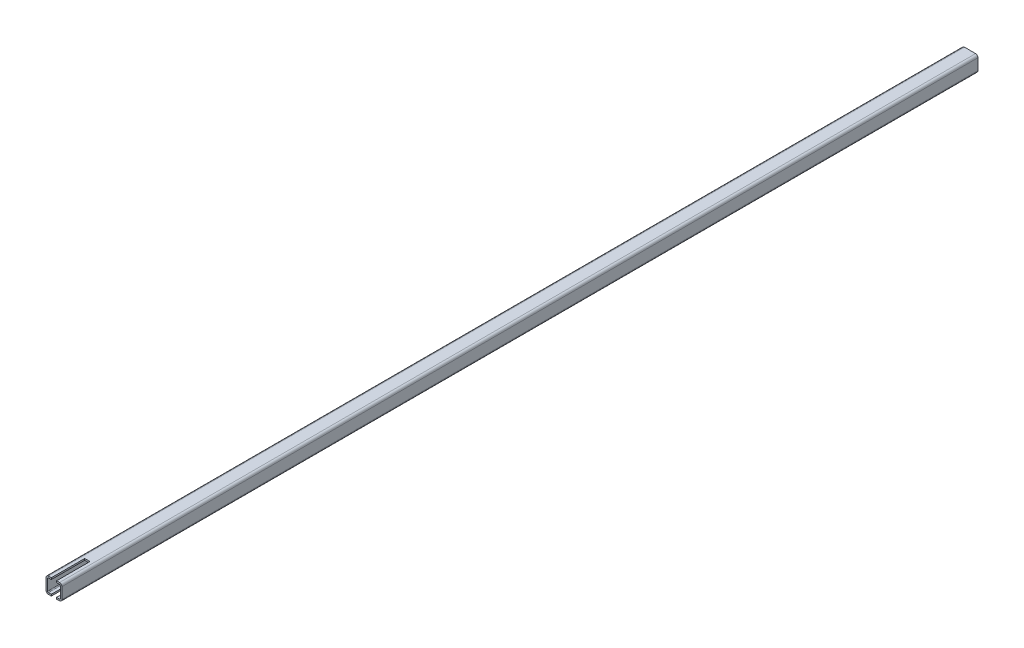
ISO-10303-21;
HEADER;
FILE_DESCRIPTION(('STEP AP214'),'2;1');
FILE_NAME('part.step','',(''),(''),'','','');
FILE_SCHEMA(('AUTOMOTIVE_DESIGN { 1 0 10303 214 1 1 1 1 }'));
ENDSEC;
DATA;
#1=APPLICATION_CONTEXT('core data for automotive mechanical design processes');
#2=APPLICATION_PROTOCOL_DEFINITION('international standard','automotive_design',2000,#1);
#3=PRODUCT_CONTEXT('',#1,'mechanical');
#4=PRODUCT('Part','Part','',(#3));
#5=PRODUCT_RELATED_PRODUCT_CATEGORY('part','',(#4));
#6=PRODUCT_DEFINITION_FORMATION('','',#4);
#7=PRODUCT_DEFINITION_CONTEXT('part definition',#1,'design');
#8=PRODUCT_DEFINITION('design','',#6,#7);
#9=PRODUCT_DEFINITION_SHAPE('','',#8);
#10=(LENGTH_UNIT() NAMED_UNIT(*) SI_UNIT(.MILLI.,.METRE.));
#11=(NAMED_UNIT(*) PLANE_ANGLE_UNIT() SI_UNIT($,.RADIAN.));
#12=(NAMED_UNIT(*) SI_UNIT($,.STERADIAN.) SOLID_ANGLE_UNIT());
#13=UNCERTAINTY_MEASURE_WITH_UNIT(LENGTH_MEASURE(1.E-05),#10,'distance_accuracy_value','');
#14=(GEOMETRIC_REPRESENTATION_CONTEXT(3) GLOBAL_UNCERTAINTY_ASSIGNED_CONTEXT((#13)) GLOBAL_UNIT_ASSIGNED_CONTEXT((#10,
#11,#12)) REPRESENTATION_CONTEXT('',''));
#15=CARTESIAN_POINT('',(0.,0.,0.));
#16=DIRECTION('',(0.,0.,1.));
#17=DIRECTION('',(1.,0.,0.));
#18=AXIS2_PLACEMENT_3D('',#15,#16,#17);
#19=CARTESIAN_POINT('',(-5.24999999999987,-7.50000000000006,54.7132034788704));
#20=DIRECTION('',(0.,1.,0.));
#21=DIRECTION('',(0.,0.,1.));
#22=AXIS2_PLACEMENT_3D('',#19,#20,#21);
#23=PLANE('',#22);
#24=DIRECTION('',(0.,0.,1.));
#25=VECTOR('',#24,1.);
#26=CARTESIAN_POINT('',(2.50000000000006,-7.50000000000006,54.7132034788704));
#27=LINE('',#26,#25);
#28=CARTESIAN_POINT('',(2.50000000000006,-7.49999999999998,0.));
#29=VERTEX_POINT('',#28);
#30=CARTESIAN_POINT('',(2.50000000000006,-7.50000000000001,31.5000000432739));
#31=VERTEX_POINT('',#30);
#32=EDGE_CURVE('E237',#29,#31,#27,.T.);
#33=ORIENTED_EDGE('',*,*,#32,.F.);
#34=DIRECTION('',(-1.,0.,0.));
#35=VECTOR('',#34,1.);
#36=CARTESIAN_POINT('',(2.50000000000006,-7.49999999999998,0.));
#37=LINE('',#36,#35);
#38=CARTESIAN_POINT('',(-2.49999999999995,-7.49999999999998,0.));
#39=VERTEX_POINT('',#38);
#40=EDGE_CURVE('E221',#29,#39,#37,.T.);
#41=ORIENTED_EDGE('',*,*,#40,.T.);
#42=DIRECTION('',(0.,0.,1.));
#43=VECTOR('',#42,1.);
#44=CARTESIAN_POINT('',(-2.49999999999995,-7.50000000000006,54.7132034788704));
#45=LINE('',#44,#43);
#46=CARTESIAN_POINT('',(-2.49999999999995,-7.50000000000001,31.5000000432739));
#47=VERTEX_POINT('',#46);
#48=EDGE_CURVE('E228',#39,#47,#45,.T.);
#49=ORIENTED_EDGE('',*,*,#48,.T.);
#50=DIRECTION('',(1.,0.,0.));
#51=VECTOR('',#50,1.);
#52=CARTESIAN_POINT('',(-5.24999999999987,-7.50000000000001,31.5000000432739));
#53=LINE('',#52,#51);
#54=CARTESIAN_POINT('',(-5.24999999999987,-7.50000000000001,31.5000000432739));
#55=VERTEX_POINT('',#54);
#56=EDGE_CURVE('E312',#55,#47,#53,.T.);
#57=ORIENTED_EDGE('',*,*,#56,.F.);
#58=DIRECTION('',(0.,0.,-1.));
#59=VECTOR('',#58,1.);
#60=CARTESIAN_POINT('',(-5.24999999999987,-7.50000000000006,54.7132034788704));
#61=LINE('',#60,#59);
#62=CARTESIAN_POINT('',(-5.24999999999992,-7.49999999999995,-832.346744961956));
#63=VERTEX_POINT('',#62);
#64=EDGE_CURVE('E354',#55,#63,#61,.T.);
#65=ORIENTED_EDGE('',*,*,#64,.T.);
#66=DIRECTION('',(-1.,0.,0.));
#67=VECTOR('',#66,1.);
#68=CARTESIAN_POINT('',(-5.24999999999992,-7.49999999999995,-832.346744961956));
#69=LINE('',#68,#67);
#70=CARTESIAN_POINT('',(5.25000000000009,-7.49999999999995,-832.346744961956));
#71=VERTEX_POINT('',#70);
#72=EDGE_CURVE('E283',#71,#63,#69,.T.);
#73=ORIENTED_EDGE('',*,*,#72,.F.);
#74=DIRECTION('',(0.,0.,-1.));
#75=VECTOR('',#74,1.);
#76=CARTESIAN_POINT('',(5.25000000000014,-7.50000000000006,54.7132034788704));
#77=LINE('',#76,#75);
#78=CARTESIAN_POINT('',(5.25000000000014,-7.50000000000001,31.5000000432739));
#79=VERTEX_POINT('',#78);
#80=EDGE_CURVE('E352',#79,#71,#77,.T.);
#81=ORIENTED_EDGE('',*,*,#80,.F.);
#82=EDGE_CURVE('E311',#31,#79,#53,.T.);
#83=ORIENTED_EDGE('',*,*,#82,.F.);
#84=EDGE_LOOP('',(#33,#41,#49,#57,#65,#73,#81,#83));
#85=FACE_BOUND('',#84,.T.);
#86=ADVANCED_FACE('F38',(#85),#23,.F.);
#87=CARTESIAN_POINT('',(-5.25000000000003,7.49999999999994,54.7132034788704));
#88=DIRECTION('',(0.,-1.,0.));
#89=DIRECTION('',(0.,0.,-1.));
#90=AXIS2_PLACEMENT_3D('',#87,#88,#89);
#91=PLANE('',#90);
#92=DIRECTION('',(0.,0.,-1.));
#93=VECTOR('',#92,1.);
#94=CARTESIAN_POINT('',(2.49999999999995,7.49999999999992,54.7132034788704));
#95=LINE('',#94,#93);
#96=CARTESIAN_POINT('',(2.49999999999995,7.49999999999998,31.5000000432739));
#97=VERTEX_POINT('',#96);
#98=CARTESIAN_POINT('',(2.49999999999995,7.50000000000003,0.));
#99=VERTEX_POINT('',#98);
#100=EDGE_CURVE('E200',#97,#99,#95,.T.);
#101=ORIENTED_EDGE('',*,*,#100,.F.);
#102=DIRECTION('',(-1.,0.,0.));
#103=VECTOR('',#102,1.);
#104=CARTESIAN_POINT('',(-5.24999999999998,7.49999999999997,31.5000000432739));
#105=LINE('',#104,#103);
#106=CARTESIAN_POINT('',(5.25000000000003,7.49999999999992,31.5000000432739));
#107=VERTEX_POINT('',#106);
#108=EDGE_CURVE('E325',#107,#97,#105,.T.);
#109=ORIENTED_EDGE('',*,*,#108,.F.);
#110=DIRECTION('',(0.,0.,-1.));
#111=VECTOR('',#110,1.);
#112=CARTESIAN_POINT('',(5.24999999999998,7.49999999999992,54.7132034788704));
#113=LINE('',#112,#111);
#114=CARTESIAN_POINT('',(5.24999999999998,7.4999999999999,-832.346744961956));
#115=VERTEX_POINT('',#114);
#116=EDGE_CURVE('E362',#107,#115,#113,.T.);
#117=ORIENTED_EDGE('',*,*,#116,.T.);
#118=DIRECTION('',(1.,0.,0.));
#119=VECTOR('',#118,1.);
#120=CARTESIAN_POINT('',(-5.25000000000003,7.49999999999994,-832.346744961956));
#121=LINE('',#120,#119);
#122=CARTESIAN_POINT('',(-5.25000000000003,7.49999999999994,-832.346744961956));
#123=VERTEX_POINT('',#122);
#124=EDGE_CURVE('E271',#123,#115,#121,.T.);
#125=ORIENTED_EDGE('',*,*,#124,.F.);
#126=DIRECTION('',(0.,0.,-1.));
#127=VECTOR('',#126,1.);
#128=CARTESIAN_POINT('',(-5.25000000000003,7.49999999999994,54.7132034788704));
#129=LINE('',#128,#127);
#130=CARTESIAN_POINT('',(-5.24999999999998,7.49999999999997,31.5000000432739));
#131=VERTEX_POINT('',#130);
#132=EDGE_CURVE('E360',#131,#123,#129,.T.);
#133=ORIENTED_EDGE('',*,*,#132,.F.);
#134=CARTESIAN_POINT('',(-2.50000000000006,7.49999999999998,31.5000000432739));
#135=VERTEX_POINT('',#134);
#136=EDGE_CURVE('E324',#135,#131,#105,.T.);
#137=ORIENTED_EDGE('',*,*,#136,.F.);
#138=DIRECTION('',(0.,0.,-1.));
#139=VECTOR('',#138,1.);
#140=CARTESIAN_POINT('',(-2.50000000000006,7.49999999999992,54.7132034788704));
#141=LINE('',#140,#139);
#142=CARTESIAN_POINT('',(-2.50000000000006,7.50000000000003,0.));
#143=VERTEX_POINT('',#142);
#144=EDGE_CURVE('E53',#135,#143,#141,.T.);
#145=ORIENTED_EDGE('',*,*,#144,.T.);
#146=DIRECTION('',(-1.,0.,0.));
#147=VECTOR('',#146,1.);
#148=CARTESIAN_POINT('',(2.49999999999995,7.50000000000003,0.));
#149=LINE('',#148,#147);
#150=EDGE_CURVE('E215',#99,#143,#149,.T.);
#151=ORIENTED_EDGE('',*,*,#150,.F.);
#152=EDGE_LOOP('',(#101,#109,#117,#125,#133,#137,#145,#151));
#153=FACE_BOUND('',#152,.T.);
#154=ADVANCED_FACE('F219',(#153),#91,.F.);
#155=CARTESIAN_POINT('',(-5.25000000000003,5.99999999999995,54.7132034788703));
#156=DIRECTION('',(0.,-1.,0.));
#157=DIRECTION('',(0.,0.,-1.));
#158=AXIS2_PLACEMENT_3D('',#155,#156,#157);
#159=PLANE('',#158);
#160=DIRECTION('',(-1.,0.,0.));
#161=VECTOR('',#160,1.);
#162=CARTESIAN_POINT('',(-5.24999999999998,5.99999999999999,31.5000000432739));
#163=LINE('',#162,#161);
#164=CARTESIAN_POINT('',(5.25000000000003,5.99999999999999,31.5000000432739));
#165=VERTEX_POINT('',#164);
#166=CARTESIAN_POINT('',(2.49999999999995,6.00000000000001,31.5000000432739));
#167=VERTEX_POINT('',#166);
#168=EDGE_CURVE('E369',#165,#167,#163,.T.);
#169=ORIENTED_EDGE('',*,*,#168,.T.);
#170=DIRECTION('',(0.,0.,-1.));
#171=VECTOR('',#170,1.);
#172=CARTESIAN_POINT('',(2.49999999999995,5.99999999999996,54.7132034788703));
#173=LINE('',#172,#171);
#174=CARTESIAN_POINT('',(2.49999999999995,5.99999999999998,0.));
#175=VERTEX_POINT('',#174);
#176=EDGE_CURVE('E210',#167,#175,#173,.T.);
#177=ORIENTED_EDGE('',*,*,#176,.T.);
#178=DIRECTION('',(1.,0.,0.));
#179=VECTOR('',#178,1.);
#180=CARTESIAN_POINT('',(-5.25000000000003,5.99999999999996,0.));
#181=LINE('',#180,#179);
#182=CARTESIAN_POINT('',(-2.50000000000006,5.99999999999998,0.));
#183=VERTEX_POINT('',#182);
#184=EDGE_CURVE('E209',#183,#175,#181,.T.);
#185=ORIENTED_EDGE('',*,*,#184,.F.);
#186=DIRECTION('',(0.,0.,-1.));
#187=VECTOR('',#186,1.);
#188=CARTESIAN_POINT('',(-2.50000000000006,6.00000000000001,54.7132034788703));
#189=LINE('',#188,#187);
#190=CARTESIAN_POINT('',(-2.50000000000006,6.00000000000001,31.5000000432739));
#191=VERTEX_POINT('',#190);
#192=EDGE_CURVE('E231',#191,#183,#189,.T.);
#193=ORIENTED_EDGE('',*,*,#192,.F.);
#194=CARTESIAN_POINT('',(-5.24999999999998,5.99999999999999,31.5000000432739));
#195=VERTEX_POINT('',#194);
#196=EDGE_CURVE('E368',#191,#195,#163,.T.);
#197=ORIENTED_EDGE('',*,*,#196,.T.);
#198=DIRECTION('',(0.,0.,-1.));
#199=VECTOR('',#198,1.);
#200=CARTESIAN_POINT('',(-5.25000000000003,5.99999999999995,54.7132034788703));
#201=LINE('',#200,#199);
#202=CARTESIAN_POINT('',(-5.25000000000003,5.99999999999971,-832.346744961956));
#203=VERTEX_POINT('',#202);
#204=EDGE_CURVE('E336',#195,#203,#201,.T.);
#205=ORIENTED_EDGE('',*,*,#204,.T.);
#206=DIRECTION('',(1.,0.,0.));
#207=VECTOR('',#206,1.);
#208=CARTESIAN_POINT('',(-5.25000000000003,5.99999999999971,-832.346744961956));
#209=LINE('',#208,#207);
#210=CARTESIAN_POINT('',(5.24999999999998,5.99999999999984,-832.346744961956));
#211=VERTEX_POINT('',#210);
#212=EDGE_CURVE('E258',#203,#211,#209,.T.);
#213=ORIENTED_EDGE('',*,*,#212,.T.);
#214=DIRECTION('',(0.,0.,-1.));
#215=VECTOR('',#214,1.);
#216=CARTESIAN_POINT('',(5.24999999999998,5.99999999999995,54.7132034788703));
#217=LINE('',#216,#215);
#218=EDGE_CURVE('E338',#165,#211,#217,.T.);
#219=ORIENTED_EDGE('',*,*,#218,.F.);
#220=EDGE_LOOP('',(#169,#177,#185,#193,#197,#205,#213,#219));
#221=FACE_BOUND('',#220,.T.);
#222=ADVANCED_FACE('F384',(#221),#159,.T.);
#223=CARTESIAN_POINT('',(-5.25000000000009,-6.00000000000003,54.7132034788704));
#224=DIRECTION('',(0.,1.,0.));
#225=DIRECTION('',(-1.,0.,0.));
#226=AXIS2_PLACEMENT_3D('',#223,#224,#225);
#227=PLANE('',#226);
#228=DIRECTION('',(-1.,0.,0.));
#229=VECTOR('',#228,1.);
#230=CARTESIAN_POINT('',(-5.25000000000003,-6.00000000000009,0.));
#231=LINE('',#230,#229);
#232=CARTESIAN_POINT('',(2.49999999999995,-6.00000000000003,-1.11022302462516E-13));
#233=VERTEX_POINT('',#232);
#234=CARTESIAN_POINT('',(-2.50000000000006,-6.00000000000003,-1.11022302462516E-13));
#235=VERTEX_POINT('',#234);
#236=EDGE_CURVE('E12',#233,#235,#231,.T.);
#237=ORIENTED_EDGE('',*,*,#236,.F.);
#238=DIRECTION('',(0.,0.,1.));
#239=VECTOR('',#238,1.);
#240=CARTESIAN_POINT('',(2.49999999999984,-6.00000000000003,54.7132034788704));
#241=LINE('',#240,#239);
#242=CARTESIAN_POINT('',(2.49999999999995,-6.00000000000006,31.5000000432739));
#243=VERTEX_POINT('',#242);
#244=EDGE_CURVE('E234',#233,#243,#241,.T.);
#245=ORIENTED_EDGE('',*,*,#244,.T.);
#246=DIRECTION('',(1.,0.,0.));
#247=VECTOR('',#246,1.);
#248=CARTESIAN_POINT('',(-5.24999999999998,-6.00000000000003,31.5000000432739));
#249=LINE('',#248,#247);
#250=CARTESIAN_POINT('',(5.25000000000003,-6.00000000000006,31.5000000432739));
#251=VERTEX_POINT('',#250);
#252=EDGE_CURVE('E298',#243,#251,#249,.T.);
#253=ORIENTED_EDGE('',*,*,#252,.T.);
#254=DIRECTION('',(0.,0.,-1.));
#255=VECTOR('',#254,1.);
#256=CARTESIAN_POINT('',(5.24999999999992,-6.00000000000003,54.7132034788704));
#257=LINE('',#256,#255);
#258=CARTESIAN_POINT('',(5.25000000000009,-5.99999999999989,-832.346744961956));
#259=VERTEX_POINT('',#258);
#260=EDGE_CURVE('E344',#251,#259,#257,.T.);
#261=ORIENTED_EDGE('',*,*,#260,.T.);
#262=DIRECTION('',(-1.,0.,0.));
#263=VECTOR('',#262,1.);
#264=CARTESIAN_POINT('',(-5.24999999999992,-5.99999999999989,-832.346744961956));
#265=LINE('',#264,#263);
#266=CARTESIAN_POINT('',(-5.24999999999992,-5.99999999999989,-832.346744961956));
#267=VERTEX_POINT('',#266);
#268=EDGE_CURVE('E246',#259,#267,#265,.T.);
#269=ORIENTED_EDGE('',*,*,#268,.T.);
#270=DIRECTION('',(0.,0.,-1.));
#271=VECTOR('',#270,1.);
#272=CARTESIAN_POINT('',(-5.25000000000009,-6.00000000000003,54.7132034788704));
#273=LINE('',#272,#271);
#274=CARTESIAN_POINT('',(-5.24999999999998,-6.00000000000003,31.5000000432739));
#275=VERTEX_POINT('',#274);
#276=EDGE_CURVE('E346',#275,#267,#273,.T.);
#277=ORIENTED_EDGE('',*,*,#276,.F.);
#278=CARTESIAN_POINT('',(-2.50000000000006,-6.00000000000003,31.5000000432739));
#279=VERTEX_POINT('',#278);
#280=EDGE_CURVE('E299',#275,#279,#249,.T.);
#281=ORIENTED_EDGE('',*,*,#280,.T.);
#282=DIRECTION('',(0.,0.,1.));
#283=VECTOR('',#282,1.);
#284=CARTESIAN_POINT('',(-2.50000000000011,-6.00000000000003,54.7132034788704));
#285=LINE('',#284,#283);
#286=EDGE_CURVE('E61',#235,#279,#285,.T.);
#287=ORIENTED_EDGE('',*,*,#286,.F.);
#288=EDGE_LOOP('',(#237,#245,#253,#261,#269,#277,#281,#287));
#289=FACE_BOUND('',#288,.T.);
#290=ADVANCED_FACE('F457',(#289),#227,.T.);
#291=CARTESIAN_POINT('',(-6.49999999999995,16.0000000000002,31.5000000432739));
#292=DIRECTION('',(0.,0.,1.));
#293=DIRECTION('',(1.,0.,0.));
#294=AXIS2_PLACEMENT_3D('',#291,#292,#293);
#295=PLANE('',#294);
#296=ORIENTED_EDGE('',*,*,#108,.T.);
#297=DIRECTION('',(0.,-1.,0.));
#298=VECTOR('',#297,1.);
#299=CARTESIAN_POINT('',(2.49999999999995,16.0000000000001,31.5000000432739));
#300=LINE('',#299,#298);
#301=EDGE_CURVE('E46',#97,#167,#300,.T.);
#302=ORIENTED_EDGE('',*,*,#301,.T.);
#303=ORIENTED_EDGE('',*,*,#168,.F.);
#304=CARTESIAN_POINT('',(5.25000000000003,5.24999999999992,31.5000000432739));
#305=DIRECTION('',(0.,0.,1.));
#306=DIRECTION('',(0.,-1.,0.));
#307=AXIS2_PLACEMENT_3D('',#304,#305,#306);
#308=CIRCLE('',#307,0.749999999999999);
#309=CARTESIAN_POINT('',(6.00000000000001,5.24999999999996,31.5000000432739));
#310=VERTEX_POINT('',#309);
#311=EDGE_CURVE('E267',#310,#165,#308,.T.);
#312=ORIENTED_EDGE('',*,*,#311,.F.);
#313=DIRECTION('',(0.,1.,0.));
#314=VECTOR('',#313,1.);
#315=CARTESIAN_POINT('',(6.00000000000001,5.24999999999996,31.5000000432739));
#316=LINE('',#315,#314);
#317=CARTESIAN_POINT('',(6.00000000000001,-5.25000000000009,31.5000000432739));
#318=VERTEX_POINT('',#317);
#319=EDGE_CURVE('E292',#318,#310,#316,.T.);
#320=ORIENTED_EDGE('',*,*,#319,.F.);
#321=CARTESIAN_POINT('',(5.25000000000003,-5.25000000000009,31.5000000432739));
#322=DIRECTION('',(0.,0.,1.));
#323=DIRECTION('',(0.,-1.,0.));
#324=AXIS2_PLACEMENT_3D('',#321,#322,#323);
#325=CIRCLE('',#324,0.749999999999999);
#326=EDGE_CURVE('E295',#251,#318,#325,.T.);
#327=ORIENTED_EDGE('',*,*,#326,.F.);
#328=ORIENTED_EDGE('',*,*,#252,.F.);
#329=EDGE_CURVE('E374',#243,#31,#300,.T.);
#330=ORIENTED_EDGE('',*,*,#329,.T.);
#331=ORIENTED_EDGE('',*,*,#82,.T.);
#332=CARTESIAN_POINT('',(5.25000000000003,-5.25000000000009,31.5000000432739));
#333=DIRECTION('',(0.,0.,1.));
#334=DIRECTION('',(0.,-1.,0.));
#335=AXIS2_PLACEMENT_3D('',#332,#333,#334);
#336=CIRCLE('',#335,2.25);
#337=CARTESIAN_POINT('',(7.50000000000001,-5.25000000000009,31.5000000432739));
#338=VERTEX_POINT('',#337);
#339=EDGE_CURVE('E333',#79,#338,#336,.T.);
#340=ORIENTED_EDGE('',*,*,#339,.T.);
#341=DIRECTION('',(0.,1.,0.));
#342=VECTOR('',#341,1.);
#343=CARTESIAN_POINT('',(7.50000000000001,5.24999999999996,31.5000000432739));
#344=LINE('',#343,#342);
#345=CARTESIAN_POINT('',(7.50000000000001,5.24999999999994,31.5000000432739));
#346=VERTEX_POINT('',#345);
#347=EDGE_CURVE('E330',#338,#346,#344,.T.);
#348=ORIENTED_EDGE('',*,*,#347,.T.);
#349=CARTESIAN_POINT('',(5.25000000000003,5.24999999999992,31.5000000432739));
#350=DIRECTION('',(0.,0.,1.));
#351=DIRECTION('',(0.,-1.,0.));
#352=AXIS2_PLACEMENT_3D('',#349,#350,#351);
#353=CIRCLE('',#352,2.25);
#354=EDGE_CURVE('E327',#346,#107,#353,.T.);
#355=ORIENTED_EDGE('',*,*,#354,.T.);
#356=EDGE_LOOP('',(#296,#302,#303,#312,#320,#327,#328,#330,#331,#340,#348,#355));
#357=FACE_BOUND('',#356,.T.);
#358=ADVANCED_FACE('F403',(#357),#295,.T.);
#359=CARTESIAN_POINT('',(-5.25000000000009,-5.25000000000003,54.7132034788703));
#360=DIRECTION('',(0.,0.,-1.));
#361=DIRECTION('',(-1.,0.,0.));
#362=AXIS2_PLACEMENT_3D('',#359,#360,#361);
#363=CYLINDRICAL_SURFACE('',#362,2.25);
#364=CARTESIAN_POINT('',(-5.24999999999998,-5.25000000000006,31.5000000432739));
#365=DIRECTION('',(0.,0.,1.));
#366=DIRECTION('',(0.,-1.,0.));
#367=AXIS2_PLACEMENT_3D('',#364,#365,#366);
#368=CIRCLE('',#367,2.25);
#369=CARTESIAN_POINT('',(-7.50000000000001,-5.24999999999998,31.5000000432739));
#370=VERTEX_POINT('',#369);
#371=EDGE_CURVE('E315',#370,#55,#368,.T.);
#372=ORIENTED_EDGE('',*,*,#371,.F.);
#373=DIRECTION('',(0.,0.,-1.));
#374=VECTOR('',#373,1.);
#375=CARTESIAN_POINT('',(-7.50000000000012,-5.25000000000003,54.7132034788703));
#376=LINE('',#375,#374);
#377=CARTESIAN_POINT('',(-7.4999999999999,-5.24999999999992,-832.346744961956));
#378=VERTEX_POINT('',#377);
#379=EDGE_CURVE('E356',#370,#378,#376,.T.);
#380=ORIENTED_EDGE('',*,*,#379,.T.);
#381=CARTESIAN_POINT('',(-5.24999999999992,-5.24999999999992,-832.346744961956));
#382=DIRECTION('',(0.,0.,1.));
#383=DIRECTION('',(0.,-1.,0.));
#384=AXIS2_PLACEMENT_3D('',#381,#382,#383);
#385=CIRCLE('',#384,2.25);
#386=EDGE_CURVE('E280',#63,#378,#385,.F.);
#387=ORIENTED_EDGE('',*,*,#386,.F.);
#388=ORIENTED_EDGE('',*,*,#64,.F.);
#389=EDGE_LOOP('',(#372,#380,#387,#388));
#390=FACE_BOUND('',#389,.T.);
#391=ADVANCED_FACE('F425',(#390),#363,.T.);
#392=CARTESIAN_POINT('',(-7.50000000000001,5.24999999999994,54.7132034788703));
#393=DIRECTION('',(1.,0.,0.));
#394=DIRECTION('',(0.,0.,-1.));
#395=AXIS2_PLACEMENT_3D('',#392,#393,#394);
#396=PLANE('',#395);
#397=DIRECTION('',(0.,-1.,0.));
#398=VECTOR('',#397,1.);
#399=CARTESIAN_POINT('',(-7.50000000000001,5.24999999999996,31.5000000432739));
#400=LINE('',#399,#398);
#401=CARTESIAN_POINT('',(-7.50000000000001,5.24999999999999,31.5000000432739));
#402=VERTEX_POINT('',#401);
#403=EDGE_CURVE('E318',#402,#370,#400,.T.);
#404=ORIENTED_EDGE('',*,*,#403,.F.);
#405=DIRECTION('',(0.,0.,-1.));
#406=VECTOR('',#405,1.);
#407=CARTESIAN_POINT('',(-7.50000000000001,5.24999999999994,54.7132034788703));
#408=LINE('',#407,#406);
#409=CARTESIAN_POINT('',(-7.50000000000001,5.24999999999996,-832.346744961956));
#410=VERTEX_POINT('',#409);
#411=EDGE_CURVE('E358',#402,#410,#408,.T.);
#412=ORIENTED_EDGE('',*,*,#411,.T.);
#413=DIRECTION('',(0.,1.,0.));
#414=VECTOR('',#413,1.);
#415=CARTESIAN_POINT('',(-7.50000000000001,5.24999999999996,-832.346744961956));
#416=LINE('',#415,#414);
#417=EDGE_CURVE('E277',#378,#410,#416,.T.);
#418=ORIENTED_EDGE('',*,*,#417,.F.);
#419=ORIENTED_EDGE('',*,*,#379,.F.);
#420=EDGE_LOOP('',(#404,#412,#418,#419));
#421=FACE_BOUND('',#420,.T.);
#422=ADVANCED_FACE('F429',(#421),#396,.F.);
#423=CARTESIAN_POINT('',(-5.25000000000003,5.24999999999994,54.7132034788703));
#424=DIRECTION('',(0.,0.,-1.));
#425=DIRECTION('',(-1.,0.,0.));
#426=AXIS2_PLACEMENT_3D('',#423,#424,#425);
#427=CYLINDRICAL_SURFACE('',#426,2.25);
#428=CARTESIAN_POINT('',(-5.24999999999998,5.24999999999996,31.5000000432739));
#429=DIRECTION('',(0.,0.,1.));
#430=DIRECTION('',(0.,-1.,0.));
#431=AXIS2_PLACEMENT_3D('',#428,#429,#430);
#432=CIRCLE('',#431,2.25);
#433=EDGE_CURVE('E321',#131,#402,#432,.T.);
#434=ORIENTED_EDGE('',*,*,#433,.F.);
#435=ORIENTED_EDGE('',*,*,#132,.T.);
#436=CARTESIAN_POINT('',(-5.25000000000003,5.24999999999996,-832.346744961956));
#437=DIRECTION('',(0.,0.,1.));
#438=DIRECTION('',(0.,-1.,0.));
#439=AXIS2_PLACEMENT_3D('',#436,#437,#438);
#440=CIRCLE('',#439,2.25);
#441=EDGE_CURVE('E274',#410,#123,#440,.F.);
#442=ORIENTED_EDGE('',*,*,#441,.F.);
#443=ORIENTED_EDGE('',*,*,#411,.F.);
#444=EDGE_LOOP('',(#434,#435,#442,#443));
#445=FACE_BOUND('',#444,.T.);
#446=ADVANCED_FACE('F434',(#445),#427,.T.);
#447=CARTESIAN_POINT('',(5.24999999999998,5.24999999999992,54.7132034788703));
#448=DIRECTION('',(0.,0.,-1.));
#449=DIRECTION('',(-1.,0.,0.));
#450=AXIS2_PLACEMENT_3D('',#447,#448,#449);
#451=CYLINDRICAL_SURFACE('',#450,2.25);
#452=ORIENTED_EDGE('',*,*,#354,.F.);
#453=DIRECTION('',(0.,0.,-1.));
#454=VECTOR('',#453,1.);
#455=CARTESIAN_POINT('',(7.49999999999995,5.24999999999994,54.7132034788703));
#456=LINE('',#455,#454);
#457=CARTESIAN_POINT('',(7.50000000000001,5.24999999999999,-832.346744961956));
#458=VERTEX_POINT('',#457);
#459=EDGE_CURVE('E364',#346,#458,#456,.T.);
#460=ORIENTED_EDGE('',*,*,#459,.T.);
#461=CARTESIAN_POINT('',(5.24999999999998,5.24999999999998,-832.346744961956));
#462=DIRECTION('',(0.,0.,1.));
#463=DIRECTION('',(0.,-1.,0.));
#464=AXIS2_PLACEMENT_3D('',#461,#462,#463);
#465=CIRCLE('',#464,2.25);
#466=EDGE_CURVE('E268',#115,#458,#465,.F.);
#467=ORIENTED_EDGE('',*,*,#466,.F.);
#468=ORIENTED_EDGE('',*,*,#116,.F.);
#469=EDGE_LOOP('',(#452,#460,#467,#468));
#470=FACE_BOUND('',#469,.T.);
#471=ADVANCED_FACE('F408',(#470),#451,.T.);
#472=CARTESIAN_POINT('',(7.49999999999995,5.24999999999994,54.7132034788703));
#473=DIRECTION('',(-1.,0.,0.));
#474=DIRECTION('',(0.,0.,1.));
#475=AXIS2_PLACEMENT_3D('',#472,#473,#474);
#476=PLANE('',#475);
#477=ORIENTED_EDGE('',*,*,#347,.F.);
#478=DIRECTION('',(0.,0.,-1.));
#479=VECTOR('',#478,1.);
#480=CARTESIAN_POINT('',(7.4999999999999,-5.25000000000006,54.7132034788703));
#481=LINE('',#480,#479);
#482=CARTESIAN_POINT('',(7.50000000000012,-5.24999999999992,-832.346744961956));
#483=VERTEX_POINT('',#482);
#484=EDGE_CURVE('E366',#338,#483,#481,.T.);
#485=ORIENTED_EDGE('',*,*,#484,.T.);
#486=DIRECTION('',(0.,-1.,0.));
#487=VECTOR('',#486,1.);
#488=CARTESIAN_POINT('',(7.50000000000001,5.24999999999999,-832.346744961956));
#489=LINE('',#488,#487);
#490=EDGE_CURVE('E245',#458,#483,#489,.T.);
#491=ORIENTED_EDGE('',*,*,#490,.F.);
#492=ORIENTED_EDGE('',*,*,#459,.F.);
#493=EDGE_LOOP('',(#477,#485,#491,#492));
#494=FACE_BOUND('',#493,.T.);
#495=ADVANCED_FACE('F414',(#494),#476,.F.);
#496=CARTESIAN_POINT('',(5.24999999999992,-5.25000000000003,54.7132034788703));
#497=DIRECTION('',(0.,0.,-1.));
#498=DIRECTION('',(-1.,0.,0.));
#499=AXIS2_PLACEMENT_3D('',#496,#497,#498);
#500=CYLINDRICAL_SURFACE('',#499,2.25);
#501=ORIENTED_EDGE('',*,*,#339,.F.);
#502=ORIENTED_EDGE('',*,*,#80,.T.);
#503=CARTESIAN_POINT('',(5.25000000000009,-5.24999999999992,-832.346744961956));
#504=DIRECTION('',(0.,0.,1.));
#505=DIRECTION('',(0.,-1.,0.));
#506=AXIS2_PLACEMENT_3D('',#503,#504,#505);
#507=CIRCLE('',#506,2.25);
#508=EDGE_CURVE('E264',#483,#71,#507,.F.);
#509=ORIENTED_EDGE('',*,*,#508,.F.);
#510=ORIENTED_EDGE('',*,*,#484,.F.);
#511=EDGE_LOOP('',(#501,#502,#509,#510));
#512=FACE_BOUND('',#511,.T.);
#513=ADVANCED_FACE('F40',(#512),#500,.T.);
#514=CARTESIAN_POINT('',(5.24999999999998,5.24999999999992,54.7132034788703));
#515=DIRECTION('',(0.,0.,-1.));
#516=DIRECTION('',(-1.,0.,0.));
#517=AXIS2_PLACEMENT_3D('',#514,#515,#516);
#518=CYLINDRICAL_SURFACE('',#517,0.749999999999999);
#519=DIRECTION('',(0.,0.,-1.));
#520=VECTOR('',#519,1.);
#521=CARTESIAN_POINT('',(5.99999999999995,5.24999999999996,54.7132034788703));
#522=LINE('',#521,#520);
#523=CARTESIAN_POINT('',(6.00000000000001,5.24999999999999,-832.346744961956));
#524=VERTEX_POINT('',#523);
#525=EDGE_CURVE('E340',#310,#524,#522,.T.);
#526=ORIENTED_EDGE('',*,*,#525,.F.);
#527=ORIENTED_EDGE('',*,*,#311,.T.);
#528=ORIENTED_EDGE('',*,*,#218,.T.);
#529=CARTESIAN_POINT('',(5.24999999999998,5.24999999999998,-832.346744961956));
#530=DIRECTION('',(0.,0.,1.));
#531=DIRECTION('',(0.,-1.,0.));
#532=AXIS2_PLACEMENT_3D('',#529,#530,#531);
#533=CIRCLE('',#532,0.749999999999999);
#534=EDGE_CURVE('E255',#211,#524,#533,.F.);
#535=ORIENTED_EDGE('',*,*,#534,.T.);
#536=EDGE_LOOP('',(#526,#527,#528,#535));
#537=FACE_BOUND('',#536,.T.);
#538=ADVANCED_FACE('F402',(#537),#518,.F.);
#539=CARTESIAN_POINT('',(5.99999999999995,5.24999999999996,54.7132034788703));
#540=DIRECTION('',(-1.,0.,0.));
#541=DIRECTION('',(0.,0.,1.));
#542=AXIS2_PLACEMENT_3D('',#539,#540,#541);
#543=PLANE('',#542);
#544=DIRECTION('',(0.,0.,-1.));
#545=VECTOR('',#544,1.);
#546=CARTESIAN_POINT('',(5.99999999999989,-5.25000000000003,54.7132034788703));
#547=LINE('',#546,#545);
#548=CARTESIAN_POINT('',(6.00000000000012,-5.24999999999992,-832.346744961956));
#549=VERTEX_POINT('',#548);
#550=EDGE_CURVE('E342',#318,#549,#547,.T.);
#551=ORIENTED_EDGE('',*,*,#550,.F.);
#552=ORIENTED_EDGE('',*,*,#319,.T.);
#553=ORIENTED_EDGE('',*,*,#525,.T.);
#554=DIRECTION('',(0.,-1.,0.));
#555=VECTOR('',#554,1.);
#556=CARTESIAN_POINT('',(6.00000000000001,5.24999999999999,-832.346744961956));
#557=LINE('',#556,#555);
#558=EDGE_CURVE('E252',#524,#549,#557,.T.);
#559=ORIENTED_EDGE('',*,*,#558,.T.);
#560=EDGE_LOOP('',(#551,#552,#553,#559));
#561=FACE_BOUND('',#560,.T.);
#562=ADVANCED_FACE('F487',(#561),#543,.T.);
#563=CARTESIAN_POINT('',(5.24999999999992,-5.25000000000003,54.7132034788703));
#564=DIRECTION('',(0.,0.,-1.));
#565=DIRECTION('',(-1.,0.,0.));
#566=AXIS2_PLACEMENT_3D('',#563,#564,#565);
#567=CYLINDRICAL_SURFACE('',#566,0.749999999999999);
#568=ORIENTED_EDGE('',*,*,#260,.F.);
#569=ORIENTED_EDGE('',*,*,#326,.T.);
#570=ORIENTED_EDGE('',*,*,#550,.T.);
#571=CARTESIAN_POINT('',(5.25000000000009,-5.24999999999992,-832.346744961956));
#572=DIRECTION('',(0.,0.,1.));
#573=DIRECTION('',(0.,-1.,0.));
#574=AXIS2_PLACEMENT_3D('',#571,#572,#573);
#575=CIRCLE('',#574,0.749999999999999);
#576=EDGE_CURVE('E249',#549,#259,#575,.F.);
#577=ORIENTED_EDGE('',*,*,#576,.T.);
#578=EDGE_LOOP('',(#568,#569,#570,#577));
#579=FACE_BOUND('',#578,.T.);
#580=ADVANCED_FACE('F481',(#579),#567,.F.);
#581=CARTESIAN_POINT('',(-5.25000000000009,-5.25000000000003,54.7132034788703));
#582=DIRECTION('',(0.,0.,-1.));
#583=DIRECTION('',(-1.,0.,0.));
#584=AXIS2_PLACEMENT_3D('',#581,#582,#583);
#585=CYLINDRICAL_SURFACE('',#584,0.75);
#586=DIRECTION('',(0.,0.,-1.));
#587=VECTOR('',#586,1.);
#588=CARTESIAN_POINT('',(-6.00000000000012,-5.25000000000003,54.7132034788703));
#589=LINE('',#588,#587);
#590=CARTESIAN_POINT('',(-6.00000000000001,-5.25000000000003,31.5000000432739));
#591=VERTEX_POINT('',#590);
#592=CARTESIAN_POINT('',(-5.99999999999989,-5.24999999999992,-832.346744961956));
#593=VERTEX_POINT('',#592);
#594=EDGE_CURVE('E348',#591,#593,#589,.T.);
#595=ORIENTED_EDGE('',*,*,#594,.F.);
#596=CARTESIAN_POINT('',(-5.24999999999998,-5.25000000000006,31.5000000432739));
#597=DIRECTION('',(0.,0.,1.));
#598=DIRECTION('',(0.,-1.,0.));
#599=AXIS2_PLACEMENT_3D('',#596,#597,#598);
#600=CIRCLE('',#599,0.75);
#601=EDGE_CURVE('E302',#591,#275,#600,.T.);
#602=ORIENTED_EDGE('',*,*,#601,.T.);
#603=ORIENTED_EDGE('',*,*,#276,.T.);
#604=CARTESIAN_POINT('',(-5.24999999999992,-5.24999999999992,-832.346744961956));
#605=DIRECTION('',(0.,0.,1.));
#606=DIRECTION('',(0.,-1.,0.));
#607=AXIS2_PLACEMENT_3D('',#604,#605,#606);
#608=CIRCLE('',#607,0.75);
#609=EDGE_CURVE('E242',#267,#593,#608,.F.);
#610=ORIENTED_EDGE('',*,*,#609,.T.);
#611=EDGE_LOOP('',(#595,#602,#603,#610));
#612=FACE_BOUND('',#611,.T.);
#613=ADVANCED_FACE('F476',(#612),#585,.F.);
#614=CARTESIAN_POINT('',(-6.00000000000001,5.24999999999994,54.7132034788703));
#615=DIRECTION('',(1.,0.,0.));
#616=DIRECTION('',(0.,1.,0.));
#617=AXIS2_PLACEMENT_3D('',#614,#615,#616);
#618=PLANE('',#617);
#619=DIRECTION('',(0.,0.,-1.));
#620=VECTOR('',#619,1.);
#621=CARTESIAN_POINT('',(-6.00000000000001,5.24999999999994,54.7132034788703));
#622=LINE('',#621,#620);
#623=CARTESIAN_POINT('',(-6.00000000000001,5.24999999999996,31.5000000432739));
#624=VERTEX_POINT('',#623);
#625=CARTESIAN_POINT('',(-6.00000000000001,5.24999999999996,-832.346744961956));
#626=VERTEX_POINT('',#625);
#627=EDGE_CURVE('E350',#624,#626,#622,.T.);
#628=ORIENTED_EDGE('',*,*,#627,.F.);
#629=DIRECTION('',(0.,-1.,0.));
#630=VECTOR('',#629,1.);
#631=CARTESIAN_POINT('',(-6.00000000000001,5.24999999999996,31.5000000432739));
#632=LINE('',#631,#630);
#633=EDGE_CURVE('E305',#624,#591,#632,.T.);
#634=ORIENTED_EDGE('',*,*,#633,.T.);
#635=ORIENTED_EDGE('',*,*,#594,.T.);
#636=DIRECTION('',(0.,1.,0.));
#637=VECTOR('',#636,1.);
#638=CARTESIAN_POINT('',(-6.00000000000001,5.24999999999996,-832.346744961956));
#639=LINE('',#638,#637);
#640=EDGE_CURVE('E241',#593,#626,#639,.T.);
#641=ORIENTED_EDGE('',*,*,#640,.T.);
#642=EDGE_LOOP('',(#628,#634,#635,#641));
#643=FACE_BOUND('',#642,.T.);
#644=ADVANCED_FACE('F472',(#643),#618,.T.);
#645=CARTESIAN_POINT('',(-5.25000000000003,5.24999999999994,54.7132034788703));
#646=DIRECTION('',(0.,0.,-1.));
#647=DIRECTION('',(-1.,0.,0.));
#648=AXIS2_PLACEMENT_3D('',#645,#646,#647);
#649=CYLINDRICAL_SURFACE('',#648,0.75);
#650=ORIENTED_EDGE('',*,*,#204,.F.);
#651=CARTESIAN_POINT('',(-5.24999999999998,5.24999999999996,31.5000000432739));
#652=DIRECTION('',(0.,0.,1.));
#653=DIRECTION('',(0.,-1.,0.));
#654=AXIS2_PLACEMENT_3D('',#651,#652,#653);
#655=CIRCLE('',#654,0.75);
#656=EDGE_CURVE('E308',#195,#624,#655,.T.);
#657=ORIENTED_EDGE('',*,*,#656,.T.);
#658=ORIENTED_EDGE('',*,*,#627,.T.);
#659=CARTESIAN_POINT('',(-5.25000000000003,5.24999999999996,-832.346744961956));
#660=DIRECTION('',(0.,0.,1.));
#661=DIRECTION('',(0.,-1.,0.));
#662=AXIS2_PLACEMENT_3D('',#659,#660,#661);
#663=CIRCLE('',#662,0.75);
#664=EDGE_CURVE('E261',#626,#203,#663,.F.);
#665=ORIENTED_EDGE('',*,*,#664,.T.);
#666=EDGE_LOOP('',(#650,#657,#658,#665));
#667=FACE_BOUND('',#666,.T.);
#668=ADVANCED_FACE('F390',(#667),#649,.F.);
#669=DIRECTION('',(0.,-1.,0.));
#670=VECTOR('',#669,1.);
#671=CARTESIAN_POINT('',(-2.50000000000006,16.0000000000002,31.5000000432739));
#672=LINE('',#671,#670);
#673=EDGE_CURVE('E373',#135,#191,#672,.T.);
#674=ORIENTED_EDGE('',*,*,#673,.F.);
#675=ORIENTED_EDGE('',*,*,#136,.T.);
#676=ORIENTED_EDGE('',*,*,#433,.T.);
#677=ORIENTED_EDGE('',*,*,#403,.T.);
#678=ORIENTED_EDGE('',*,*,#371,.T.);
#679=ORIENTED_EDGE('',*,*,#56,.T.);
#680=EDGE_CURVE('E372',#279,#47,#672,.T.);
#681=ORIENTED_EDGE('',*,*,#680,.F.);
#682=ORIENTED_EDGE('',*,*,#280,.F.);
#683=ORIENTED_EDGE('',*,*,#601,.F.);
#684=ORIENTED_EDGE('',*,*,#633,.F.);
#685=ORIENTED_EDGE('',*,*,#656,.F.);
#686=ORIENTED_EDGE('',*,*,#196,.F.);
#687=EDGE_LOOP('',(#674,#675,#676,#677,#678,#679,#681,#682,#683,#684,#685,#686));
#688=FACE_BOUND('',#687,.T.);
#689=ADVANCED_FACE('F386',(#688),#295,.T.);
#690=CARTESIAN_POINT('',(0.,5.55111512312578E-13,-832.346744961956));
#691=DIRECTION('',(0.,0.,1.));
#692=DIRECTION('',(1.,0.,0.));
#693=AXIS2_PLACEMENT_3D('',#690,#691,#692);
#694=PLANE('',#693);
#695=ORIENTED_EDGE('',*,*,#508,.T.);
#696=ORIENTED_EDGE('',*,*,#72,.T.);
#697=ORIENTED_EDGE('',*,*,#386,.T.);
#698=ORIENTED_EDGE('',*,*,#417,.T.);
#699=ORIENTED_EDGE('',*,*,#441,.T.);
#700=ORIENTED_EDGE('',*,*,#124,.T.);
#701=ORIENTED_EDGE('',*,*,#466,.T.);
#702=ORIENTED_EDGE('',*,*,#490,.T.);
#703=EDGE_LOOP('',(#695,#696,#697,#698,#699,#700,#701,#702));
#704=FACE_BOUND('',#703,.T.);
#705=ORIENTED_EDGE('',*,*,#640,.F.);
#706=ORIENTED_EDGE('',*,*,#609,.F.);
#707=ORIENTED_EDGE('',*,*,#268,.F.);
#708=ORIENTED_EDGE('',*,*,#576,.F.);
#709=ORIENTED_EDGE('',*,*,#558,.F.);
#710=ORIENTED_EDGE('',*,*,#534,.F.);
#711=ORIENTED_EDGE('',*,*,#212,.F.);
#712=ORIENTED_EDGE('',*,*,#664,.F.);
#713=EDGE_LOOP('',(#705,#706,#707,#708,#709,#710,#711,#712));
#714=FACE_BOUND('',#713,.T.);
#715=ADVANCED_FACE('F397',(#704,#714),#694,.F.);
#716=CARTESIAN_POINT('',(-2.50000000000006,-2.16296425215035E-08,54.0247914459114));
#717=DIRECTION('',(-1.,0.,0.));
#718=DIRECTION('',(0.,0.,1.));
#719=AXIS2_PLACEMENT_3D('',#716,#717,#718);
#720=PLANE('',#719);
#721=DIRECTION('',(0.,-1.,0.));
#722=VECTOR('',#721,1.);
#723=CARTESIAN_POINT('',(-2.50000000000006,7.50000000000003,0.));
#724=LINE('',#723,#722);
#725=EDGE_CURVE('E652',#235,#39,#724,.T.);
#726=ORIENTED_EDGE('',*,*,#725,.F.);
#727=ORIENTED_EDGE('',*,*,#286,.T.);
#728=ORIENTED_EDGE('',*,*,#680,.T.);
#729=ORIENTED_EDGE('',*,*,#48,.F.);
#730=EDGE_LOOP('',(#726,#727,#728,#729));
#731=FACE_BOUND('',#730,.T.);
#732=ADVANCED_FACE('F471',(#731),#720,.F.);
#733=CARTESIAN_POINT('',(2.49999999999989,-2.16296425215035E-08,54.0247914459114));
#734=DIRECTION('',(-1.,0.,0.));
#735=DIRECTION('',(0.,0.,1.));
#736=AXIS2_PLACEMENT_3D('',#733,#734,#735);
#737=PLANE('',#736);
#738=ORIENTED_EDGE('',*,*,#32,.T.);
#739=ORIENTED_EDGE('',*,*,#329,.F.);
#740=ORIENTED_EDGE('',*,*,#244,.F.);
#741=DIRECTION('',(0.,-1.,0.));
#742=VECTOR('',#741,1.);
#743=CARTESIAN_POINT('',(2.49999999999995,7.50000000000003,0.));
#744=LINE('',#743,#742);
#745=EDGE_CURVE('E217',#233,#29,#744,.T.);
#746=ORIENTED_EDGE('',*,*,#745,.T.);
#747=EDGE_LOOP('',(#738,#739,#740,#746));
#748=FACE_BOUND('',#747,.T.);
#749=ADVANCED_FACE('F591',(#748),#737,.T.);
#750=CARTESIAN_POINT('',(2.49999999999995,7.50000000000003,0.));
#751=DIRECTION('',(0.,0.,-1.));
#752=DIRECTION('',(0.,-1.,0.));
#753=AXIS2_PLACEMENT_3D('',#750,#751,#752);
#754=PLANE('',#753);
#755=ORIENTED_EDGE('',*,*,#236,.T.);
#756=ORIENTED_EDGE('',*,*,#725,.T.);
#757=ORIENTED_EDGE('',*,*,#40,.F.);
#758=ORIENTED_EDGE('',*,*,#745,.F.);
#759=EDGE_LOOP('',(#755,#756,#757,#758));
#760=FACE_BOUND('',#759,.T.);
#761=ADVANCED_FACE('F602',(#760),#754,.F.);
#762=ORIENTED_EDGE('',*,*,#184,.T.);
#763=EDGE_CURVE('E203',#99,#175,#744,.T.);
#764=ORIENTED_EDGE('',*,*,#763,.F.);
#765=ORIENTED_EDGE('',*,*,#150,.T.);
#766=EDGE_CURVE('E653',#143,#183,#724,.T.);
#767=ORIENTED_EDGE('',*,*,#766,.T.);
#768=EDGE_LOOP('',(#762,#764,#765,#767));
#769=FACE_BOUND('',#768,.T.);
#770=ADVANCED_FACE('F213',(#769),#754,.F.);
#771=ORIENTED_EDGE('',*,*,#100,.T.);
#772=ORIENTED_EDGE('',*,*,#763,.T.);
#773=ORIENTED_EDGE('',*,*,#176,.F.);
#774=ORIENTED_EDGE('',*,*,#301,.F.);
#775=EDGE_LOOP('',(#771,#772,#773,#774));
#776=FACE_BOUND('',#775,.T.);
#777=ADVANCED_FACE('F202',(#776),#737,.T.);
#778=ORIENTED_EDGE('',*,*,#673,.T.);
#779=ORIENTED_EDGE('',*,*,#192,.T.);
#780=ORIENTED_EDGE('',*,*,#766,.F.);
#781=ORIENTED_EDGE('',*,*,#144,.F.);
#782=EDGE_LOOP('',(#778,#779,#780,#781));
#783=FACE_BOUND('',#782,.T.);
#784=ADVANCED_FACE('F380',(#783),#720,.F.);
#785=CLOSED_SHELL('',(#86,#154,#222,#290,#358,#391,#422,#446,#471,#495,#513,#538,#562,#580,#613,
#644,#668,#689,#715,#732,#749,#761,#770,#777,#784));
#786=MANIFOLD_SOLID_BREP('B2',#785);
#787=ADVANCED_BREP_SHAPE_REPRESENTATION('',(#18,#786),#14);
#788=SHAPE_DEFINITION_REPRESENTATION(#9,#787);
ENDSEC;
END-ISO-10303-21;
